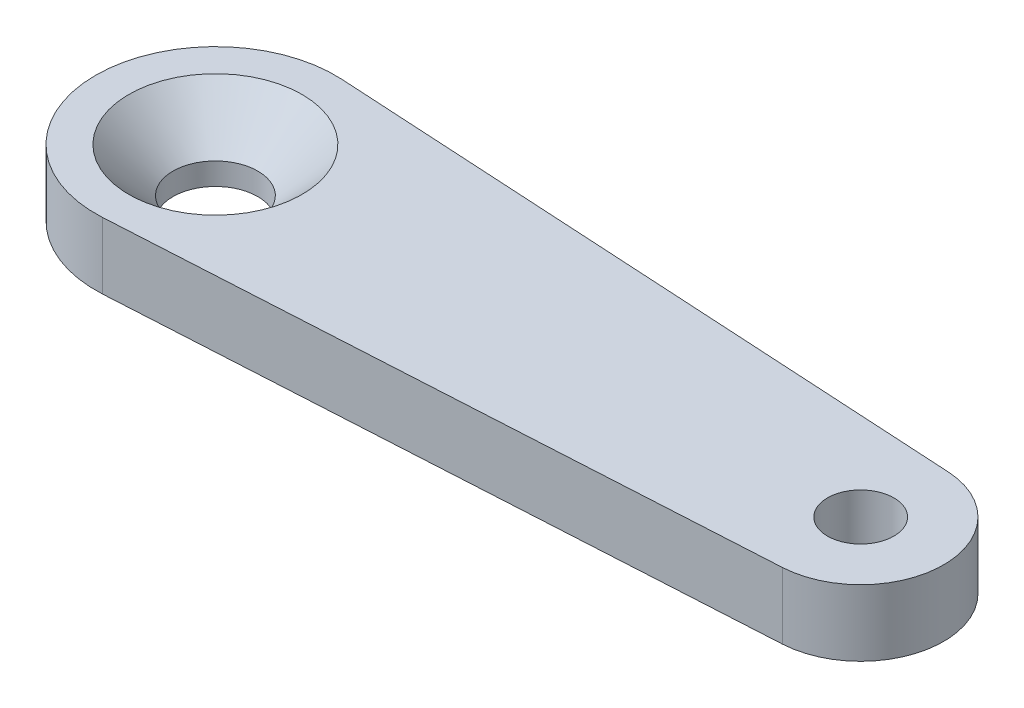
ISO-10303-21;
HEADER;
FILE_DESCRIPTION(('STEP AP214'),'2;1');
FILE_NAME('part.step','',(''),(''),'','','');
FILE_SCHEMA(('AUTOMOTIVE_DESIGN { 1 0 10303 214 1 1 1 1 }'));
ENDSEC;
DATA;
#1=APPLICATION_CONTEXT('core data for automotive mechanical design processes');
#2=APPLICATION_PROTOCOL_DEFINITION('international standard','automotive_design',2000,#1);
#3=PRODUCT_CONTEXT('',#1,'mechanical');
#4=PRODUCT('Part','Part','',(#3));
#5=PRODUCT_RELATED_PRODUCT_CATEGORY('part','',(#4));
#6=PRODUCT_DEFINITION_FORMATION('','',#4);
#7=PRODUCT_DEFINITION_CONTEXT('part definition',#1,'design');
#8=PRODUCT_DEFINITION('design','',#6,#7);
#9=PRODUCT_DEFINITION_SHAPE('','',#8);
#10=(LENGTH_UNIT() NAMED_UNIT(*) SI_UNIT(.MILLI.,.METRE.));
#11=(NAMED_UNIT(*) PLANE_ANGLE_UNIT() SI_UNIT($,.RADIAN.));
#12=(NAMED_UNIT(*) SI_UNIT($,.STERADIAN.) SOLID_ANGLE_UNIT());
#13=UNCERTAINTY_MEASURE_WITH_UNIT(LENGTH_MEASURE(1.E-05),#10,'distance_accuracy_value','');
#14=(GEOMETRIC_REPRESENTATION_CONTEXT(3) GLOBAL_UNCERTAINTY_ASSIGNED_CONTEXT((#13)) GLOBAL_UNIT_ASSIGNED_CONTEXT((#10,
#11,#12)) REPRESENTATION_CONTEXT('',''));
#15=CARTESIAN_POINT('',(0.,0.,0.));
#16=DIRECTION('',(0.,0.,1.));
#17=DIRECTION('',(1.,0.,0.));
#18=AXIS2_PLACEMENT_3D('',#15,#16,#17);
#19=CARTESIAN_POINT('',(0.,1.8,0.));
#20=DIRECTION('',(0.,-1.,0.));
#21=DIRECTION('',(0.,0.,-1.));
#22=AXIS2_PLACEMENT_3D('',#19,#20,#21);
#23=PLANE('',#22);
#24=CARTESIAN_POINT('',(0.,1.8,0.));
#25=DIRECTION('',(0.,-1.,0.));
#26=DIRECTION('',(0.,0.,-1.));
#27=AXIS2_PLACEMENT_3D('',#24,#25,#26);
#28=CIRCLE('',#27,2.35);
#29=CARTESIAN_POINT('',(0.,1.8,-2.35));
#30=VERTEX_POINT('',#29);
#31=EDGE_CURVE('E11',#30,#30,#28,.T.);
#32=ORIENTED_EDGE('',*,*,#31,.T.);
#33=EDGE_LOOP('',(#32));
#34=FACE_BOUND('',#33,.T.);
#35=CARTESIAN_POINT('',(0.,1.8,0.));
#36=DIRECTION('',(0.,1.,0.));
#37=DIRECTION('',(0.,0.,-1.));
#38=AXIS2_PLACEMENT_3D('',#35,#36,#37);
#39=CIRCLE('',#38,3.25);
#40=CARTESIAN_POINT('',(0.185714285714286,1.8,-3.24468953893614));
#41=VERTEX_POINT('',#40);
#42=CARTESIAN_POINT('',(0.185714285714286,1.8,3.24468953893614));
#43=VERTEX_POINT('',#42);
#44=EDGE_CURVE('E87',#41,#43,#39,.T.);
#45=ORIENTED_EDGE('',*,*,#44,.T.);
#46=DIRECTION('',(0.998366011980351,0.,-0.0571428571428572));
#47=VECTOR('',#46,1.);
#48=CARTESIAN_POINT('',(17.6285714285714,1.8,2.24632352695579));
#49=LINE('',#48,#47);
#50=CARTESIAN_POINT('',(17.6285714285714,1.8,2.24632352695579));
#51=VERTEX_POINT('',#50);
#52=EDGE_CURVE('E82',#43,#51,#49,.T.);
#53=ORIENTED_EDGE('',*,*,#52,.T.);
#54=CARTESIAN_POINT('',(17.5,1.8,0.));
#55=DIRECTION('',(0.,1.,0.));
#56=DIRECTION('',(0.,0.,-1.));
#57=AXIS2_PLACEMENT_3D('',#54,#55,#56);
#58=CIRCLE('',#57,2.25);
#59=CARTESIAN_POINT('',(17.6285714285714,1.8,-2.24632352695579));
#60=VERTEX_POINT('',#59);
#61=EDGE_CURVE('E85',#51,#60,#58,.T.);
#62=ORIENTED_EDGE('',*,*,#61,.T.);
#63=DIRECTION('',(-0.998366011980351,0.,-0.0571428571428571));
#64=VECTOR('',#63,1.);
#65=CARTESIAN_POINT('',(0.185714285714286,1.8,-3.24468953893614));
#66=LINE('',#65,#64);
#67=EDGE_CURVE('E51',#60,#41,#66,.T.);
#68=ORIENTED_EDGE('',*,*,#67,.T.);
#69=EDGE_LOOP('',(#45,#53,#62,#68));
#70=FACE_BOUND('',#69,.T.);
#71=CARTESIAN_POINT('',(17.5,1.8,0.));
#72=DIRECTION('',(0.,1.,0.));
#73=DIRECTION('',(0.,0.,1.));
#74=AXIS2_PLACEMENT_3D('',#71,#72,#73);
#75=CIRCLE('',#74,0.9);
#76=CARTESIAN_POINT('',(17.5,1.8,0.9));
#77=VERTEX_POINT('',#76);
#78=EDGE_CURVE('E105',#77,#77,#75,.T.);
#79=ORIENTED_EDGE('',*,*,#78,.F.);
#80=EDGE_LOOP('',(#79));
#81=FACE_BOUND('',#80,.T.);
#82=ADVANCED_FACE('F34',(#34,#70,#81),#23,.F.);
#83=CARTESIAN_POINT('',(0.,0.,0.));
#84=DIRECTION('',(0.,-1.,0.));
#85=DIRECTION('',(0.,0.,-1.));
#86=AXIS2_PLACEMENT_3D('',#83,#84,#85);
#87=PLANE('',#86);
#88=CARTESIAN_POINT('',(17.5,0.,0.));
#89=DIRECTION('',(0.,1.,0.));
#90=DIRECTION('',(0.,0.,1.));
#91=AXIS2_PLACEMENT_3D('',#88,#89,#90);
#92=CIRCLE('',#91,0.9);
#93=CARTESIAN_POINT('',(17.5,0.,0.9));
#94=VERTEX_POINT('',#93);
#95=EDGE_CURVE('E153',#94,#94,#92,.T.);
#96=ORIENTED_EDGE('',*,*,#95,.T.);
#97=EDGE_LOOP('',(#96));
#98=FACE_BOUND('',#97,.T.);
#99=CARTESIAN_POINT('',(0.,0.,0.));
#100=DIRECTION('',(0.,1.,0.));
#101=DIRECTION('',(0.,0.,-1.));
#102=AXIS2_PLACEMENT_3D('',#99,#100,#101);
#103=CIRCLE('',#102,3.25);
#104=CARTESIAN_POINT('',(0.185714285714286,0.,-3.24468953893614));
#105=VERTEX_POINT('',#104);
#106=CARTESIAN_POINT('',(0.185714285714286,0.,3.24468953893614));
#107=VERTEX_POINT('',#106);
#108=EDGE_CURVE('E102',#105,#107,#103,.T.);
#109=ORIENTED_EDGE('',*,*,#108,.F.);
#110=DIRECTION('',(-0.998366011980351,0.,-0.0571428571428571));
#111=VECTOR('',#110,1.);
#112=CARTESIAN_POINT('',(0.185714285714286,0.,-3.24468953893614));
#113=LINE('',#112,#111);
#114=CARTESIAN_POINT('',(17.6285714285714,0.,-2.24632352695579));
#115=VERTEX_POINT('',#114);
#116=EDGE_CURVE('E74',#115,#105,#113,.T.);
#117=ORIENTED_EDGE('',*,*,#116,.F.);
#118=CARTESIAN_POINT('',(17.5,0.,0.));
#119=DIRECTION('',(0.,1.,0.));
#120=DIRECTION('',(0.,0.,-1.));
#121=AXIS2_PLACEMENT_3D('',#118,#119,#120);
#122=CIRCLE('',#121,2.25);
#123=CARTESIAN_POINT('',(17.6285714285714,0.,2.24632352695579));
#124=VERTEX_POINT('',#123);
#125=EDGE_CURVE('E68',#124,#115,#122,.T.);
#126=ORIENTED_EDGE('',*,*,#125,.F.);
#127=DIRECTION('',(0.998366011980351,0.,-0.0571428571428572));
#128=VECTOR('',#127,1.);
#129=CARTESIAN_POINT('',(17.6285714285714,0.,2.24632352695579));
#130=LINE('',#129,#128);
#131=EDGE_CURVE('E92',#107,#124,#130,.T.);
#132=ORIENTED_EDGE('',*,*,#131,.F.);
#133=EDGE_LOOP('',(#109,#117,#126,#132));
#134=FACE_BOUND('',#133,.T.);
#135=CARTESIAN_POINT('',(0.,0.,0.));
#136=DIRECTION('',(0.,1.,0.));
#137=DIRECTION('',(0.,0.,1.));
#138=AXIS2_PLACEMENT_3D('',#135,#136,#137);
#139=CIRCLE('',#138,1.15);
#140=CARTESIAN_POINT('',(0.,0.,1.15));
#141=VERTEX_POINT('',#140);
#142=EDGE_CURVE('E152',#141,#141,#139,.T.);
#143=ORIENTED_EDGE('',*,*,#142,.T.);
#144=EDGE_LOOP('',(#143));
#145=FACE_BOUND('',#144,.T.);
#146=ADVANCED_FACE('F126',(#98,#134,#145),#87,.T.);
#147=CARTESIAN_POINT('',(0.,1.8,0.));
#148=DIRECTION('',(0.,-1.,0.));
#149=DIRECTION('',(0.,0.,-1.));
#150=AXIS2_PLACEMENT_3D('',#147,#148,#149);
#151=CYLINDRICAL_SURFACE('',#150,3.25);
#152=ORIENTED_EDGE('',*,*,#108,.T.);
#153=DIRECTION('',(0.,-1.,0.));
#154=VECTOR('',#153,1.);
#155=CARTESIAN_POINT('',(0.185714285714286,1.8,3.24468953893614));
#156=LINE('',#155,#154);
#157=EDGE_CURVE('E93',#43,#107,#156,.T.);
#158=ORIENTED_EDGE('',*,*,#157,.F.);
#159=ORIENTED_EDGE('',*,*,#44,.F.);
#160=DIRECTION('',(0.,-1.,0.));
#161=VECTOR('',#160,1.);
#162=CARTESIAN_POINT('',(0.185714285714286,1.8,-3.24468953893614));
#163=LINE('',#162,#161);
#164=EDGE_CURVE('E98',#41,#105,#163,.T.);
#165=ORIENTED_EDGE('',*,*,#164,.T.);
#166=EDGE_LOOP('',(#152,#158,#159,#165));
#167=FACE_BOUND('',#166,.T.);
#168=ADVANCED_FACE('F132',(#167),#151,.T.);
#169=CARTESIAN_POINT('',(17.6285714285714,1.8,2.24632352695579));
#170=DIRECTION('',(-0.0571428571428572,0.,-0.998366011980351));
#171=DIRECTION('',(-0.998366011980351,0.,0.0571428571428572));
#172=AXIS2_PLACEMENT_3D('',#169,#170,#171);
#173=PLANE('',#172);
#174=ORIENTED_EDGE('',*,*,#131,.T.);
#175=DIRECTION('',(0.,-1.,0.));
#176=VECTOR('',#175,1.);
#177=CARTESIAN_POINT('',(17.6285714285714,1.8,2.24632352695579));
#178=LINE('',#177,#176);
#179=EDGE_CURVE('E90',#51,#124,#178,.T.);
#180=ORIENTED_EDGE('',*,*,#179,.F.);
#181=ORIENTED_EDGE('',*,*,#52,.F.);
#182=ORIENTED_EDGE('',*,*,#157,.T.);
#183=EDGE_LOOP('',(#174,#180,#181,#182));
#184=FACE_BOUND('',#183,.T.);
#185=ADVANCED_FACE('F91',(#184),#173,.F.);
#186=CARTESIAN_POINT('',(17.5,1.8,0.));
#187=DIRECTION('',(0.,-1.,0.));
#188=DIRECTION('',(0.,0.,-1.));
#189=AXIS2_PLACEMENT_3D('',#186,#187,#188);
#190=CYLINDRICAL_SURFACE('',#189,2.25);
#191=ORIENTED_EDGE('',*,*,#125,.T.);
#192=DIRECTION('',(0.,-1.,0.));
#193=VECTOR('',#192,1.);
#194=CARTESIAN_POINT('',(17.6285714285714,1.8,-2.24632352695579));
#195=LINE('',#194,#193);
#196=EDGE_CURVE('E94',#60,#115,#195,.T.);
#197=ORIENTED_EDGE('',*,*,#196,.F.);
#198=ORIENTED_EDGE('',*,*,#61,.F.);
#199=ORIENTED_EDGE('',*,*,#179,.T.);
#200=EDGE_LOOP('',(#191,#197,#198,#199));
#201=FACE_BOUND('',#200,.T.);
#202=ADVANCED_FACE('F96',(#201),#190,.T.);
#203=CARTESIAN_POINT('',(0.185714285714286,1.8,-3.24468953893614));
#204=DIRECTION('',(-0.0571428571428571,0.,0.998366011980351));
#205=DIRECTION('',(0.998366011980351,0.,0.0571428571428571));
#206=AXIS2_PLACEMENT_3D('',#203,#204,#205);
#207=PLANE('',#206);
#208=ORIENTED_EDGE('',*,*,#116,.T.);
#209=ORIENTED_EDGE('',*,*,#164,.F.);
#210=ORIENTED_EDGE('',*,*,#67,.F.);
#211=ORIENTED_EDGE('',*,*,#196,.T.);
#212=EDGE_LOOP('',(#208,#209,#210,#211));
#213=FACE_BOUND('',#212,.T.);
#214=ADVANCED_FACE('F137',(#213),#207,.F.);
#215=CARTESIAN_POINT('',(17.5,1.8,0.));
#216=DIRECTION('',(0.,-1.,0.));
#217=DIRECTION('',(0.,0.,-1.));
#218=AXIS2_PLACEMENT_3D('',#215,#216,#217);
#219=CYLINDRICAL_SURFACE('',#218,0.9);
#220=ORIENTED_EDGE('',*,*,#78,.T.);
#221=EDGE_LOOP('',(#220));
#222=FACE_BOUND('',#221,.T.);
#223=ORIENTED_EDGE('',*,*,#95,.F.);
#224=EDGE_LOOP('',(#223));
#225=FACE_BOUND('',#224,.T.);
#226=ADVANCED_FACE('F122',(#222,#225),#219,.F.);
#227=CARTESIAN_POINT('',(0.,1.8,0.));
#228=DIRECTION('',(0.,-1.,0.));
#229=DIRECTION('',(0.,0.,-1.));
#230=AXIS2_PLACEMENT_3D('',#227,#228,#229);
#231=CYLINDRICAL_SURFACE('',#230,1.15);
#232=CARTESIAN_POINT('',(0.,0.599999999999998,0.));
#233=DIRECTION('',(0.,-1.,0.));
#234=DIRECTION('',(0.,0.,-1.));
#235=AXIS2_PLACEMENT_3D('',#232,#233,#234);
#236=CIRCLE('',#235,1.15);
#237=CARTESIAN_POINT('',(0.,0.599999999999998,-1.15));
#238=VERTEX_POINT('',#237);
#239=EDGE_CURVE('E43',#238,#238,#236,.F.);
#240=ORIENTED_EDGE('',*,*,#239,.T.);
#241=EDGE_LOOP('',(#240));
#242=FACE_BOUND('',#241,.T.);
#243=ORIENTED_EDGE('',*,*,#142,.F.);
#244=EDGE_LOOP('',(#243));
#245=FACE_BOUND('',#244,.T.);
#246=ADVANCED_FACE('F114',(#242,#245),#231,.F.);
#247=CARTESIAN_POINT('',(0.,0.599999999999998,0.));
#248=DIRECTION('',(0.,1.,0.));
#249=DIRECTION('',(0.,0.,1.));
#250=AXIS2_PLACEMENT_3D('',#247,#248,#249);
#251=CONICAL_SURFACE('',#250,1.15,0.78539816339745);
#252=ORIENTED_EDGE('',*,*,#31,.F.);
#253=EDGE_LOOP('',(#252));
#254=FACE_BOUND('',#253,.T.);
#255=ORIENTED_EDGE('',*,*,#239,.F.);
#256=EDGE_LOOP('',(#255));
#257=FACE_BOUND('',#256,.T.);
#258=ADVANCED_FACE('F36',(#254,#257),#251,.F.);
#259=CLOSED_SHELL('',(#82,#146,#168,#185,#202,#214,#226,#246,#258));
#260=MANIFOLD_SOLID_BREP('B2',#259);
#261=ADVANCED_BREP_SHAPE_REPRESENTATION('',(#18,#260),#14);
#262=SHAPE_DEFINITION_REPRESENTATION(#9,#261);
ENDSEC;
END-ISO-10303-21;
